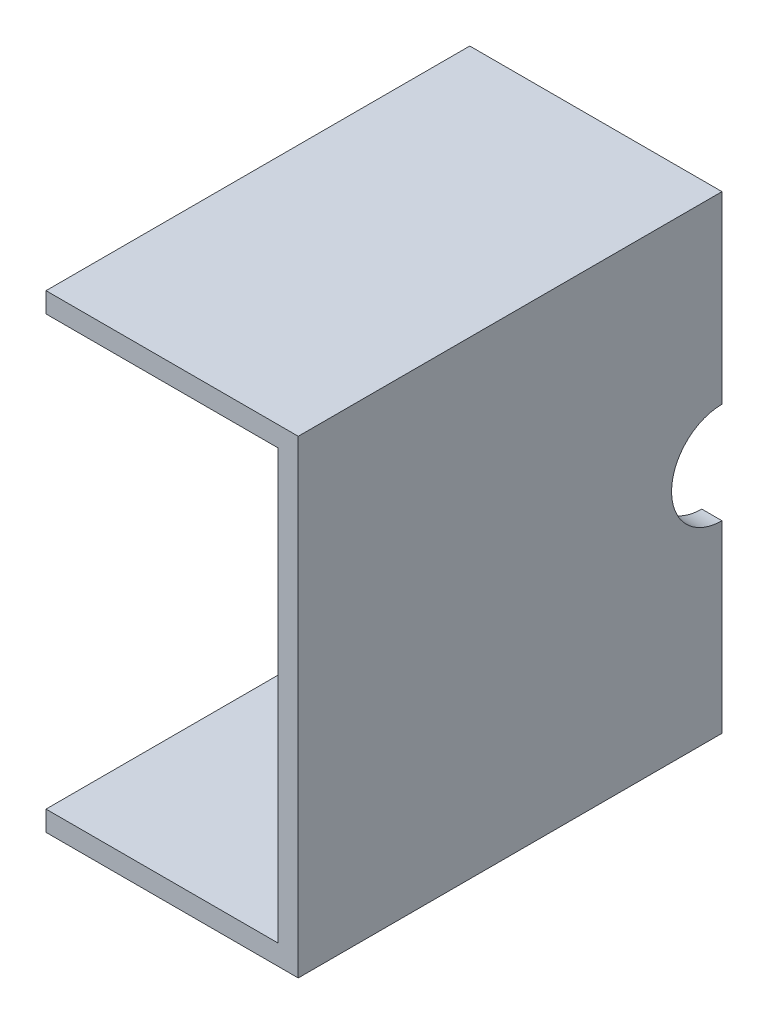
ISO-10303-21;
HEADER;
FILE_DESCRIPTION(('STEP AP214'),'2;1');
FILE_NAME('part.step','',(''),(''),'','','');
FILE_SCHEMA(('AUTOMOTIVE_DESIGN { 1 0 10303 214 1 1 1 1 }'));
ENDSEC;
DATA;
#1=APPLICATION_CONTEXT('core data for automotive mechanical design processes');
#2=APPLICATION_PROTOCOL_DEFINITION('international standard','automotive_design',2000,#1);
#3=PRODUCT_CONTEXT('',#1,'mechanical');
#4=PRODUCT('Part','Part','',(#3));
#5=PRODUCT_RELATED_PRODUCT_CATEGORY('part','',(#4));
#6=PRODUCT_DEFINITION_FORMATION('','',#4);
#7=PRODUCT_DEFINITION_CONTEXT('part definition',#1,'design');
#8=PRODUCT_DEFINITION('design','',#6,#7);
#9=PRODUCT_DEFINITION_SHAPE('','',#8);
#10=(LENGTH_UNIT() NAMED_UNIT(*) SI_UNIT(.MILLI.,.METRE.));
#11=(NAMED_UNIT(*) PLANE_ANGLE_UNIT() SI_UNIT($,.RADIAN.));
#12=(NAMED_UNIT(*) SI_UNIT($,.STERADIAN.) SOLID_ANGLE_UNIT());
#13=UNCERTAINTY_MEASURE_WITH_UNIT(LENGTH_MEASURE(1.E-05),#10,'distance_accuracy_value','');
#14=(GEOMETRIC_REPRESENTATION_CONTEXT(3) GLOBAL_UNCERTAINTY_ASSIGNED_CONTEXT((#13)) GLOBAL_UNIT_ASSIGNED_CONTEXT((#10,
#11,#12)) REPRESENTATION_CONTEXT('',''));
#15=CARTESIAN_POINT('',(0.,0.,0.));
#16=DIRECTION('',(0.,0.,1.));
#17=DIRECTION('',(1.,0.,0.));
#18=AXIS2_PLACEMENT_3D('',#15,#16,#17);
#19=CARTESIAN_POINT('',(0.,0.,0.));
#20=DIRECTION('',(-1.,0.,0.));
#21=DIRECTION('',(0.,0.,1.));
#22=AXIS2_PLACEMENT_3D('',#19,#20,#21);
#23=PLANE('',#22);
#24=DIRECTION('',(0.,-0.707106781186548,-0.707106781186547));
#25=VECTOR('',#24,1.);
#26=CARTESIAN_POINT('',(0.,19.95,-4.5));
#27=LINE('',#26,#25);
#28=CARTESIAN_POINT('',(0.,21.25,-3.2));
#29=VERTEX_POINT('',#28);
#30=CARTESIAN_POINT('',(0.,19.95,-4.5));
#31=VERTEX_POINT('',#30);
#32=EDGE_CURVE('E176',#29,#31,#27,.T.);
#33=ORIENTED_EDGE('',*,*,#32,.F.);
#34=DIRECTION('',(0.,0.,1.));
#35=VECTOR('',#34,1.);
#36=CARTESIAN_POINT('',(0.,21.25,-3.2));
#37=LINE('',#36,#35);
#38=CARTESIAN_POINT('',(0.,21.25,-21.));
#39=VERTEX_POINT('',#38);
#40=EDGE_CURVE('E174',#39,#29,#37,.T.);
#41=ORIENTED_EDGE('',*,*,#40,.F.);
#42=DIRECTION('',(0.,1.,0.));
#43=VECTOR('',#42,1.);
#44=CARTESIAN_POINT('',(0.,-23.25,-21.));
#45=LINE('',#44,#43);
#46=CARTESIAN_POINT('',(0.,5.,-21.));
#47=VERTEX_POINT('',#46);
#48=EDGE_CURVE('E218',#47,#39,#45,.T.);
#49=ORIENTED_EDGE('',*,*,#48,.F.);
#50=CARTESIAN_POINT('',(0.,0.,-21.));
#51=DIRECTION('',(-1.,0.,0.));
#52=DIRECTION('',(0.,0.,1.));
#53=AXIS2_PLACEMENT_3D('',#50,#51,#52);
#54=CIRCLE('',#53,5.);
#55=CARTESIAN_POINT('',(0.,-5.00000000000001,-21.));
#56=VERTEX_POINT('',#55);
#57=EDGE_CURVE('E11',#56,#47,#54,.T.);
#58=ORIENTED_EDGE('',*,*,#57,.F.);
#59=CARTESIAN_POINT('',(0.,-21.25,-21.));
#60=VERTEX_POINT('',#59);
#61=EDGE_CURVE('E229',#60,#56,#45,.T.);
#62=ORIENTED_EDGE('',*,*,#61,.F.);
#63=DIRECTION('',(0.,0.,-1.));
#64=VECTOR('',#63,1.);
#65=CARTESIAN_POINT('',(0.,-21.25,-21.));
#66=LINE('',#65,#64);
#67=CARTESIAN_POINT('',(0.,-21.25,21.));
#68=VERTEX_POINT('',#67);
#69=EDGE_CURVE('E198',#68,#60,#66,.T.);
#70=ORIENTED_EDGE('',*,*,#69,.F.);
#71=DIRECTION('',(0.,-1.,0.));
#72=VECTOR('',#71,1.);
#73=CARTESIAN_POINT('',(0.,-23.25,21.));
#74=LINE('',#73,#72);
#75=CARTESIAN_POINT('',(0.,21.25,21.));
#76=VERTEX_POINT('',#75);
#77=EDGE_CURVE('E232',#76,#68,#74,.T.);
#78=ORIENTED_EDGE('',*,*,#77,.F.);
#79=DIRECTION('',(0.,0.,1.));
#80=VECTOR('',#79,1.);
#81=CARTESIAN_POINT('',(0.,21.25,3.2));
#82=LINE('',#81,#80);
#83=CARTESIAN_POINT('',(0.,21.25,3.2));
#84=VERTEX_POINT('',#83);
#85=EDGE_CURVE('E158',#84,#76,#82,.T.);
#86=ORIENTED_EDGE('',*,*,#85,.F.);
#87=DIRECTION('',(0.,0.707106781186548,-0.707106781186547));
#88=VECTOR('',#87,1.);
#89=CARTESIAN_POINT('',(0.,21.25,3.2));
#90=LINE('',#89,#88);
#91=CARTESIAN_POINT('',(0.,19.95,4.5));
#92=VERTEX_POINT('',#91);
#93=EDGE_CURVE('E160',#92,#84,#90,.T.);
#94=ORIENTED_EDGE('',*,*,#93,.F.);
#95=DIRECTION('',(0.,0.,1.));
#96=VECTOR('',#95,1.);
#97=CARTESIAN_POINT('',(0.,19.95,4.5));
#98=LINE('',#97,#96);
#99=EDGE_CURVE('E178',#31,#92,#98,.T.);
#100=ORIENTED_EDGE('',*,*,#99,.F.);
#101=EDGE_LOOP('',(#33,#41,#49,#58,#62,#70,#78,#86,#94,#100));
#102=FACE_BOUND('',#101,.T.);
#103=ADVANCED_FACE('F33',(#102),#23,.T.);
#104=CARTESIAN_POINT('',(2.,-23.25,-21.));
#105=DIRECTION('',(0.,0.,1.));
#106=DIRECTION('',(1.,0.,0.));
#107=AXIS2_PLACEMENT_3D('',#104,#105,#106);
#108=PLANE('',#107);
#109=ORIENTED_EDGE('',*,*,#61,.T.);
#110=DIRECTION('',(1.,0.,0.));
#111=VECTOR('',#110,1.);
#112=CARTESIAN_POINT('',(-21.,-5.,-21.));
#113=LINE('',#112,#111);
#114=CARTESIAN_POINT('',(2.,-5.,-21.));
#115=VERTEX_POINT('',#114);
#116=EDGE_CURVE('E55',#56,#115,#113,.T.);
#117=ORIENTED_EDGE('',*,*,#116,.T.);
#118=DIRECTION('',(0.,1.,0.));
#119=VECTOR('',#118,1.);
#120=CARTESIAN_POINT('',(2.,-23.25,-21.));
#121=LINE('',#120,#119);
#122=CARTESIAN_POINT('',(2.,-23.25,-21.));
#123=VERTEX_POINT('',#122);
#124=EDGE_CURVE('E219',#123,#115,#121,.T.);
#125=ORIENTED_EDGE('',*,*,#124,.F.);
#126=DIRECTION('',(-1.,0.,0.));
#127=VECTOR('',#126,1.);
#128=CARTESIAN_POINT('',(2.,-23.25,-21.));
#129=LINE('',#128,#127);
#130=CARTESIAN_POINT('',(-23.,-23.25,-21.));
#131=VERTEX_POINT('',#130);
#132=EDGE_CURVE('E228',#123,#131,#129,.T.);
#133=ORIENTED_EDGE('',*,*,#132,.T.);
#134=DIRECTION('',(0.,-1.,0.));
#135=VECTOR('',#134,1.);
#136=CARTESIAN_POINT('',(-23.,-23.25,-21.));
#137=LINE('',#136,#135);
#138=CARTESIAN_POINT('',(-23.,-21.25,-21.));
#139=VERTEX_POINT('',#138);
#140=EDGE_CURVE('E200',#139,#131,#137,.T.);
#141=ORIENTED_EDGE('',*,*,#140,.F.);
#142=DIRECTION('',(1.,0.,0.));
#143=VECTOR('',#142,1.);
#144=CARTESIAN_POINT('',(-23.,-21.25,-21.));
#145=LINE('',#144,#143);
#146=EDGE_CURVE('E210',#139,#60,#145,.T.);
#147=ORIENTED_EDGE('',*,*,#146,.T.);
#148=EDGE_LOOP('',(#109,#117,#125,#133,#141,#147));
#149=FACE_BOUND('',#148,.T.);
#150=ADVANCED_FACE('F252',(#149),#108,.F.);
#151=CARTESIAN_POINT('',(2.,5.,-21.));
#152=VERTEX_POINT('',#151);
#153=CARTESIAN_POINT('',(2.,23.25,-21.));
#154=VERTEX_POINT('',#153);
#155=EDGE_CURVE('E223',#152,#154,#121,.T.);
#156=ORIENTED_EDGE('',*,*,#155,.F.);
#157=DIRECTION('',(1.,0.,0.));
#158=VECTOR('',#157,1.);
#159=CARTESIAN_POINT('',(-21.,5.,-21.));
#160=LINE('',#159,#158);
#161=EDGE_CURVE('E196',#47,#152,#160,.T.);
#162=ORIENTED_EDGE('',*,*,#161,.F.);
#163=ORIENTED_EDGE('',*,*,#48,.T.);
#164=DIRECTION('',(1.,0.,0.));
#165=VECTOR('',#164,1.);
#166=CARTESIAN_POINT('',(-23.,21.25,-21.));
#167=LINE('',#166,#165);
#168=CARTESIAN_POINT('',(-23.,21.25,-21.));
#169=VERTEX_POINT('',#168);
#170=EDGE_CURVE('E192',#169,#39,#167,.T.);
#171=ORIENTED_EDGE('',*,*,#170,.F.);
#172=DIRECTION('',(0.,-1.,0.));
#173=VECTOR('',#172,1.);
#174=CARTESIAN_POINT('',(-23.,23.25,-21.));
#175=LINE('',#174,#173);
#176=CARTESIAN_POINT('',(-23.,23.25,-21.));
#177=VERTEX_POINT('',#176);
#178=EDGE_CURVE('E153',#177,#169,#175,.T.);
#179=ORIENTED_EDGE('',*,*,#178,.F.);
#180=DIRECTION('',(-1.,0.,0.));
#181=VECTOR('',#180,1.);
#182=CARTESIAN_POINT('',(2.,23.25,-21.));
#183=LINE('',#182,#181);
#184=EDGE_CURVE('E41',#154,#177,#183,.T.);
#185=ORIENTED_EDGE('',*,*,#184,.F.);
#186=EDGE_LOOP('',(#156,#162,#163,#171,#179,#185));
#187=FACE_BOUND('',#186,.T.);
#188=ADVANCED_FACE('F35',(#187),#108,.F.);
#189=CARTESIAN_POINT('',(2.,23.25,21.));
#190=DIRECTION('',(0.,-1.,0.));
#191=DIRECTION('',(0.,0.,-1.));
#192=AXIS2_PLACEMENT_3D('',#189,#190,#191);
#193=PLANE('',#192);
#194=ORIENTED_EDGE('',*,*,#184,.T.);
#195=DIRECTION('',(0.,0.,-1.));
#196=VECTOR('',#195,1.);
#197=CARTESIAN_POINT('',(-23.,23.25,21.));
#198=LINE('',#197,#196);
#199=CARTESIAN_POINT('',(-23.,23.25,21.));
#200=VERTEX_POINT('',#199);
#201=EDGE_CURVE('E148',#200,#177,#198,.T.);
#202=ORIENTED_EDGE('',*,*,#201,.F.);
#203=DIRECTION('',(-1.,0.,0.));
#204=VECTOR('',#203,1.);
#205=CARTESIAN_POINT('',(2.,23.25,21.));
#206=LINE('',#205,#204);
#207=CARTESIAN_POINT('',(2.,23.25,21.));
#208=VERTEX_POINT('',#207);
#209=EDGE_CURVE('E135',#208,#200,#206,.T.);
#210=ORIENTED_EDGE('',*,*,#209,.F.);
#211=DIRECTION('',(0.,0.,1.));
#212=VECTOR('',#211,1.);
#213=CARTESIAN_POINT('',(2.,23.25,21.));
#214=LINE('',#213,#212);
#215=EDGE_CURVE('E222',#154,#208,#214,.T.);
#216=ORIENTED_EDGE('',*,*,#215,.F.);
#217=EDGE_LOOP('',(#194,#202,#210,#216));
#218=FACE_BOUND('',#217,.T.);
#219=ADVANCED_FACE('F149',(#218),#193,.F.);
#220=CARTESIAN_POINT('',(2.,-23.25,21.));
#221=DIRECTION('',(0.,0.,-1.));
#222=DIRECTION('',(-1.,0.,0.));
#223=AXIS2_PLACEMENT_3D('',#220,#221,#222);
#224=PLANE('',#223);
#225=ORIENTED_EDGE('',*,*,#209,.T.);
#226=DIRECTION('',(0.,1.,0.));
#227=VECTOR('',#226,1.);
#228=CARTESIAN_POINT('',(-23.,23.25,21.));
#229=LINE('',#228,#227);
#230=CARTESIAN_POINT('',(-23.,21.25,21.));
#231=VERTEX_POINT('',#230);
#232=EDGE_CURVE('E140',#231,#200,#229,.T.);
#233=ORIENTED_EDGE('',*,*,#232,.F.);
#234=DIRECTION('',(1.,0.,0.));
#235=VECTOR('',#234,1.);
#236=CARTESIAN_POINT('',(-23.,21.25,21.));
#237=LINE('',#236,#235);
#238=EDGE_CURVE('E173',#231,#76,#237,.T.);
#239=ORIENTED_EDGE('',*,*,#238,.T.);
#240=ORIENTED_EDGE('',*,*,#77,.T.);
#241=DIRECTION('',(1.,0.,0.));
#242=VECTOR('',#241,1.);
#243=CARTESIAN_POINT('',(-23.,-21.25,21.));
#244=LINE('',#243,#242);
#245=CARTESIAN_POINT('',(-23.,-21.25,21.));
#246=VERTEX_POINT('',#245);
#247=EDGE_CURVE('E215',#246,#68,#244,.T.);
#248=ORIENTED_EDGE('',*,*,#247,.F.);
#249=DIRECTION('',(0.,1.,0.));
#250=VECTOR('',#249,1.);
#251=CARTESIAN_POINT('',(-23.,-23.25,21.));
#252=LINE('',#251,#250);
#253=CARTESIAN_POINT('',(-23.,-23.25,21.));
#254=VERTEX_POINT('',#253);
#255=EDGE_CURVE('E206',#254,#246,#252,.T.);
#256=ORIENTED_EDGE('',*,*,#255,.F.);
#257=DIRECTION('',(-1.,0.,0.));
#258=VECTOR('',#257,1.);
#259=CARTESIAN_POINT('',(2.,-23.25,21.));
#260=LINE('',#259,#258);
#261=CARTESIAN_POINT('',(2.,-23.25,21.));
#262=VERTEX_POINT('',#261);
#263=EDGE_CURVE('E145',#262,#254,#260,.T.);
#264=ORIENTED_EDGE('',*,*,#263,.F.);
#265=DIRECTION('',(0.,-1.,0.));
#266=VECTOR('',#265,1.);
#267=CARTESIAN_POINT('',(2.,-23.25,21.));
#268=LINE('',#267,#266);
#269=EDGE_CURVE('E142',#208,#262,#268,.T.);
#270=ORIENTED_EDGE('',*,*,#269,.F.);
#271=EDGE_LOOP('',(#225,#233,#239,#240,#248,#256,#264,#270));
#272=FACE_BOUND('',#271,.T.);
#273=ADVANCED_FACE('F137',(#272),#224,.F.);
#274=CARTESIAN_POINT('',(2.,-23.25,21.));
#275=DIRECTION('',(0.,1.,0.));
#276=DIRECTION('',(0.,0.,1.));
#277=AXIS2_PLACEMENT_3D('',#274,#275,#276);
#278=PLANE('',#277);
#279=ORIENTED_EDGE('',*,*,#263,.T.);
#280=DIRECTION('',(0.,0.,1.));
#281=VECTOR('',#280,1.);
#282=CARTESIAN_POINT('',(-23.,-23.25,-21.));
#283=LINE('',#282,#281);
#284=EDGE_CURVE('E203',#131,#254,#283,.T.);
#285=ORIENTED_EDGE('',*,*,#284,.F.);
#286=ORIENTED_EDGE('',*,*,#132,.F.);
#287=DIRECTION('',(0.,0.,-1.));
#288=VECTOR('',#287,1.);
#289=CARTESIAN_POINT('',(2.,-23.25,21.));
#290=LINE('',#289,#288);
#291=EDGE_CURVE('E226',#262,#123,#290,.T.);
#292=ORIENTED_EDGE('',*,*,#291,.F.);
#293=EDGE_LOOP('',(#279,#285,#286,#292));
#294=FACE_BOUND('',#293,.T.);
#295=ADVANCED_FACE('F238',(#294),#278,.F.);
#296=CARTESIAN_POINT('',(2.,0.,0.));
#297=DIRECTION('',(-1.,0.,0.));
#298=DIRECTION('',(0.,0.,1.));
#299=AXIS2_PLACEMENT_3D('',#296,#297,#298);
#300=PLANE('',#299);
#301=ORIENTED_EDGE('',*,*,#124,.T.);
#302=CARTESIAN_POINT('',(2.,0.,-21.));
#303=DIRECTION('',(1.,0.,0.));
#304=DIRECTION('',(0.,0.,1.));
#305=AXIS2_PLACEMENT_3D('',#302,#303,#304);
#306=CIRCLE('',#305,5.);
#307=EDGE_CURVE('E194',#152,#115,#306,.T.);
#308=ORIENTED_EDGE('',*,*,#307,.F.);
#309=ORIENTED_EDGE('',*,*,#155,.T.);
#310=ORIENTED_EDGE('',*,*,#215,.T.);
#311=ORIENTED_EDGE('',*,*,#269,.T.);
#312=ORIENTED_EDGE('',*,*,#291,.T.);
#313=EDGE_LOOP('',(#301,#308,#309,#310,#311,#312));
#314=FACE_BOUND('',#313,.T.);
#315=ADVANCED_FACE('F256',(#314),#300,.F.);
#316=CARTESIAN_POINT('',(-23.,-21.25,-21.));
#317=DIRECTION('',(0.,-1.,0.));
#318=DIRECTION('',(0.,0.,-1.));
#319=AXIS2_PLACEMENT_3D('',#316,#317,#318);
#320=PLANE('',#319);
#321=ORIENTED_EDGE('',*,*,#69,.T.);
#322=ORIENTED_EDGE('',*,*,#146,.F.);
#323=DIRECTION('',(0.,0.,-1.));
#324=VECTOR('',#323,1.);
#325=CARTESIAN_POINT('',(-23.,-21.25,-21.));
#326=LINE('',#325,#324);
#327=EDGE_CURVE('E208',#246,#139,#326,.T.);
#328=ORIENTED_EDGE('',*,*,#327,.F.);
#329=ORIENTED_EDGE('',*,*,#247,.T.);
#330=EDGE_LOOP('',(#321,#322,#328,#329));
#331=FACE_BOUND('',#330,.T.);
#332=ADVANCED_FACE('F250',(#331),#320,.F.);
#333=CARTESIAN_POINT('',(-23.,0.,0.));
#334=DIRECTION('',(1.,0.,0.));
#335=DIRECTION('',(0.,0.,-1.));
#336=AXIS2_PLACEMENT_3D('',#333,#334,#335);
#337=PLANE('',#336);
#338=ORIENTED_EDGE('',*,*,#140,.T.);
#339=ORIENTED_EDGE('',*,*,#284,.T.);
#340=ORIENTED_EDGE('',*,*,#255,.T.);
#341=ORIENTED_EDGE('',*,*,#327,.T.);
#342=EDGE_LOOP('',(#338,#339,#340,#341));
#343=FACE_BOUND('',#342,.T.);
#344=ADVANCED_FACE('F242',(#343),#337,.F.);
#345=CARTESIAN_POINT('',(-21.,0.,-21.));
#346=DIRECTION('',(1.,0.,0.));
#347=DIRECTION('',(0.,0.,-1.));
#348=AXIS2_PLACEMENT_3D('',#345,#346,#347);
#349=CYLINDRICAL_SURFACE('',#348,5.);
#350=ORIENTED_EDGE('',*,*,#57,.T.);
#351=ORIENTED_EDGE('',*,*,#161,.T.);
#352=ORIENTED_EDGE('',*,*,#307,.T.);
#353=ORIENTED_EDGE('',*,*,#116,.F.);
#354=EDGE_LOOP('',(#350,#351,#352,#353));
#355=FACE_BOUND('',#354,.T.);
#356=ADVANCED_FACE('F285',(#355),#349,.F.);
#357=CARTESIAN_POINT('',(-23.,21.25,-3.2));
#358=DIRECTION('',(0.,1.,0.));
#359=DIRECTION('',(0.,0.,1.));
#360=AXIS2_PLACEMENT_3D('',#357,#358,#359);
#361=PLANE('',#360);
#362=ORIENTED_EDGE('',*,*,#40,.T.);
#363=DIRECTION('',(1.,0.,0.));
#364=VECTOR('',#363,1.);
#365=CARTESIAN_POINT('',(-23.,21.25,-3.2));
#366=LINE('',#365,#364);
#367=CARTESIAN_POINT('',(-23.,21.25,-3.2));
#368=VERTEX_POINT('',#367);
#369=EDGE_CURVE('E189',#368,#29,#366,.T.);
#370=ORIENTED_EDGE('',*,*,#369,.F.);
#371=DIRECTION('',(0.,0.,1.));
#372=VECTOR('',#371,1.);
#373=CARTESIAN_POINT('',(-23.,21.25,-3.2));
#374=LINE('',#373,#372);
#375=EDGE_CURVE('E164',#169,#368,#374,.T.);
#376=ORIENTED_EDGE('',*,*,#375,.F.);
#377=ORIENTED_EDGE('',*,*,#170,.T.);
#378=EDGE_LOOP('',(#362,#370,#376,#377));
#379=FACE_BOUND('',#378,.T.);
#380=ADVANCED_FACE('F267',(#379),#361,.F.);
#381=CARTESIAN_POINT('',(-23.,19.95,-4.5));
#382=DIRECTION('',(0.,-0.707106781186547,0.707106781186548));
#383=DIRECTION('',(0.,-0.707106781186548,-0.707106781186547));
#384=AXIS2_PLACEMENT_3D('',#381,#382,#383);
#385=PLANE('',#384);
#386=ORIENTED_EDGE('',*,*,#32,.T.);
#387=DIRECTION('',(1.,0.,0.));
#388=VECTOR('',#387,1.);
#389=CARTESIAN_POINT('',(-23.,19.95,-4.5));
#390=LINE('',#389,#388);
#391=CARTESIAN_POINT('',(-23.,19.95,-4.5));
#392=VERTEX_POINT('',#391);
#393=EDGE_CURVE('E186',#392,#31,#390,.T.);
#394=ORIENTED_EDGE('',*,*,#393,.F.);
#395=DIRECTION('',(0.,-0.707106781186548,-0.707106781186547));
#396=VECTOR('',#395,1.);
#397=CARTESIAN_POINT('',(-23.,19.95,-4.5));
#398=LINE('',#397,#396);
#399=EDGE_CURVE('E166',#368,#392,#398,.T.);
#400=ORIENTED_EDGE('',*,*,#399,.F.);
#401=ORIENTED_EDGE('',*,*,#369,.T.);
#402=EDGE_LOOP('',(#386,#394,#400,#401));
#403=FACE_BOUND('',#402,.T.);
#404=ADVANCED_FACE('F271',(#403),#385,.F.);
#405=CARTESIAN_POINT('',(-23.,19.95,4.5));
#406=DIRECTION('',(0.,1.,0.));
#407=DIRECTION('',(0.,0.,1.));
#408=AXIS2_PLACEMENT_3D('',#405,#406,#407);
#409=PLANE('',#408);
#410=ORIENTED_EDGE('',*,*,#99,.T.);
#411=DIRECTION('',(1.,0.,0.));
#412=VECTOR('',#411,1.);
#413=CARTESIAN_POINT('',(-23.,19.95,4.5));
#414=LINE('',#413,#412);
#415=CARTESIAN_POINT('',(-23.,19.95,4.5));
#416=VERTEX_POINT('',#415);
#417=EDGE_CURVE('E183',#416,#92,#414,.T.);
#418=ORIENTED_EDGE('',*,*,#417,.F.);
#419=DIRECTION('',(0.,0.,1.));
#420=VECTOR('',#419,1.);
#421=CARTESIAN_POINT('',(-23.,19.95,4.5));
#422=LINE('',#421,#420);
#423=EDGE_CURVE('E168',#392,#416,#422,.T.);
#424=ORIENTED_EDGE('',*,*,#423,.F.);
#425=ORIENTED_EDGE('',*,*,#393,.T.);
#426=EDGE_LOOP('',(#410,#418,#424,#425));
#427=FACE_BOUND('',#426,.T.);
#428=ADVANCED_FACE('F276',(#427),#409,.F.);
#429=CARTESIAN_POINT('',(-23.,21.25,3.2));
#430=DIRECTION('',(0.,-0.707106781186547,-0.707106781186548));
#431=DIRECTION('',(0.,0.707106781186548,-0.707106781186547));
#432=AXIS2_PLACEMENT_3D('',#429,#430,#431);
#433=PLANE('',#432);
#434=ORIENTED_EDGE('',*,*,#93,.T.);
#435=DIRECTION('',(1.,0.,0.));
#436=VECTOR('',#435,1.);
#437=CARTESIAN_POINT('',(-23.,21.25,3.2));
#438=LINE('',#437,#436);
#439=CARTESIAN_POINT('',(-23.,21.25,3.2));
#440=VERTEX_POINT('',#439);
#441=EDGE_CURVE('E48',#440,#84,#438,.T.);
#442=ORIENTED_EDGE('',*,*,#441,.F.);
#443=DIRECTION('',(0.,0.707106781186548,-0.707106781186547));
#444=VECTOR('',#443,1.);
#445=CARTESIAN_POINT('',(-23.,21.25,3.2));
#446=LINE('',#445,#444);
#447=EDGE_CURVE('E170',#416,#440,#446,.T.);
#448=ORIENTED_EDGE('',*,*,#447,.F.);
#449=ORIENTED_EDGE('',*,*,#417,.T.);
#450=EDGE_LOOP('',(#434,#442,#448,#449));
#451=FACE_BOUND('',#450,.T.);
#452=ADVANCED_FACE('F279',(#451),#433,.F.);
#453=CARTESIAN_POINT('',(-23.,21.25,3.2));
#454=DIRECTION('',(0.,1.,0.));
#455=DIRECTION('',(0.,0.,1.));
#456=AXIS2_PLACEMENT_3D('',#453,#454,#455);
#457=PLANE('',#456);
#458=ORIENTED_EDGE('',*,*,#85,.T.);
#459=ORIENTED_EDGE('',*,*,#238,.F.);
#460=DIRECTION('',(0.,0.,1.));
#461=VECTOR('',#460,1.);
#462=CARTESIAN_POINT('',(-23.,21.25,3.2));
#463=LINE('',#462,#461);
#464=EDGE_CURVE('E156',#440,#231,#463,.T.);
#465=ORIENTED_EDGE('',*,*,#464,.F.);
#466=ORIENTED_EDGE('',*,*,#441,.T.);
#467=EDGE_LOOP('',(#458,#459,#465,#466));
#468=FACE_BOUND('',#467,.T.);
#469=ADVANCED_FACE('F282',(#468),#457,.F.);
#470=CARTESIAN_POINT('',(-23.,0.,0.));
#471=DIRECTION('',(-1.,0.,0.));
#472=DIRECTION('',(0.,0.,1.));
#473=AXIS2_PLACEMENT_3D('',#470,#471,#472);
#474=PLANE('',#473);
#475=ORIENTED_EDGE('',*,*,#232,.T.);
#476=ORIENTED_EDGE('',*,*,#201,.T.);
#477=ORIENTED_EDGE('',*,*,#178,.T.);
#478=ORIENTED_EDGE('',*,*,#375,.T.);
#479=ORIENTED_EDGE('',*,*,#399,.T.);
#480=ORIENTED_EDGE('',*,*,#423,.T.);
#481=ORIENTED_EDGE('',*,*,#447,.T.);
#482=ORIENTED_EDGE('',*,*,#464,.T.);
#483=EDGE_LOOP('',(#475,#476,#477,#478,#479,#480,#481,#482));
#484=FACE_BOUND('',#483,.T.);
#485=ADVANCED_FACE('F155',(#484),#474,.T.);
#486=CLOSED_SHELL('',(#103,#150,#188,#219,#273,#295,#315,#332,#344,#356,#380,#404,#428,#452,
#469,#485));
#487=MANIFOLD_SOLID_BREP('B2',#486);
#488=ADVANCED_BREP_SHAPE_REPRESENTATION('',(#18,#487),#14);
#489=SHAPE_DEFINITION_REPRESENTATION(#9,#488);
ENDSEC;
END-ISO-10303-21;
